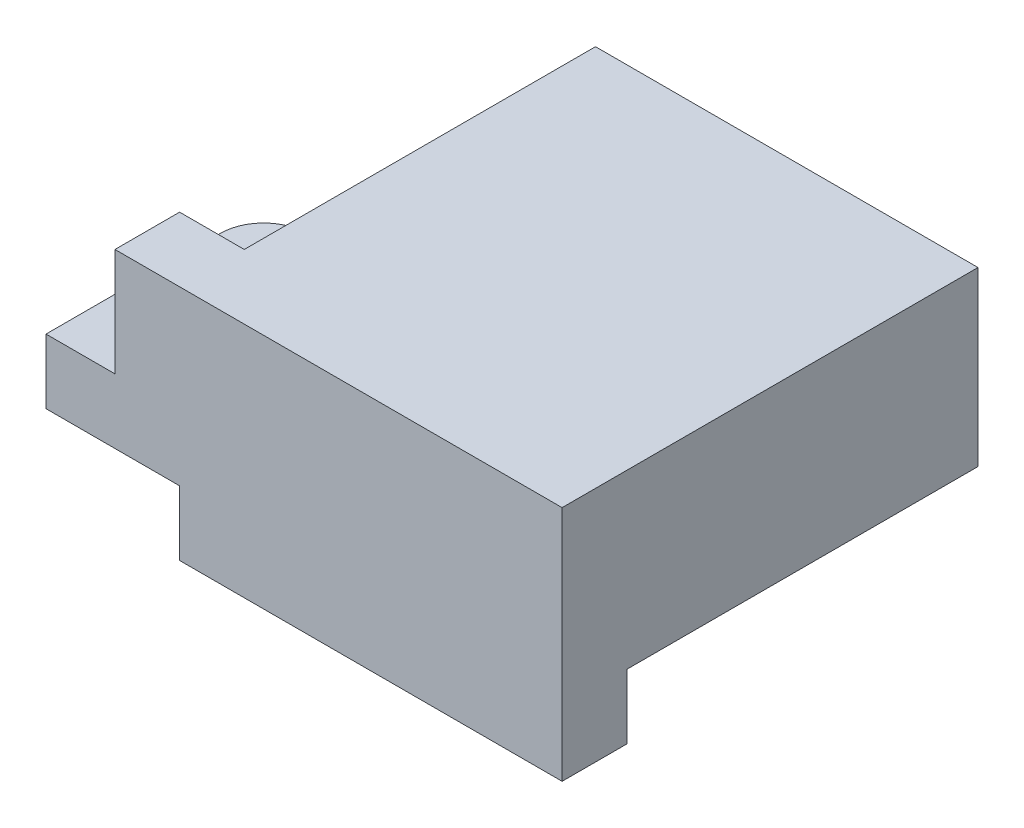
ISO-10303-21;
HEADER;
FILE_DESCRIPTION(('STEP AP214'),'2;1');
FILE_NAME('part.step','',(''),(''),'','','');
FILE_SCHEMA(('AUTOMOTIVE_DESIGN { 1 0 10303 214 1 1 1 1 }'));
ENDSEC;
DATA;
#1=APPLICATION_CONTEXT('core data for automotive mechanical design processes');
#2=APPLICATION_PROTOCOL_DEFINITION('international standard','automotive_design',2000,#1);
#3=PRODUCT_CONTEXT('',#1,'mechanical');
#4=PRODUCT('Part','Part','',(#3));
#5=PRODUCT_RELATED_PRODUCT_CATEGORY('part','',(#4));
#6=PRODUCT_DEFINITION_FORMATION('','',#4);
#7=PRODUCT_DEFINITION_CONTEXT('part definition',#1,'design');
#8=PRODUCT_DEFINITION('design','',#6,#7);
#9=PRODUCT_DEFINITION_SHAPE('','',#8);
#10=(LENGTH_UNIT() NAMED_UNIT(*) SI_UNIT(.MILLI.,.METRE.));
#11=(NAMED_UNIT(*) PLANE_ANGLE_UNIT() SI_UNIT($,.RADIAN.));
#12=(NAMED_UNIT(*) SI_UNIT($,.STERADIAN.) SOLID_ANGLE_UNIT());
#13=UNCERTAINTY_MEASURE_WITH_UNIT(LENGTH_MEASURE(1.E-05),#10,'distance_accuracy_value','');
#14=(GEOMETRIC_REPRESENTATION_CONTEXT(3) GLOBAL_UNCERTAINTY_ASSIGNED_CONTEXT((#13)) GLOBAL_UNIT_ASSIGNED_CONTEXT((#10,
#11,#12)) REPRESENTATION_CONTEXT('',''));
#15=CARTESIAN_POINT('',(0.,0.,0.));
#16=DIRECTION('',(0.,0.,1.));
#17=DIRECTION('',(1.,0.,0.));
#18=AXIS2_PLACEMENT_3D('',#15,#16,#17);
#19=CARTESIAN_POINT('',(-146.083399220501,-24.7311663924978,-18.5004782565443));
#20=DIRECTION('',(0.,-1.,0.));
#21=DIRECTION('',(1.,0.,0.));
#22=AXIS2_PLACEMENT_3D('',#19,#20,#21);
#23=PLANE('',#22);
#24=DIRECTION('',(0.,0.,-1.));
#25=VECTOR('',#24,1.);
#26=CARTESIAN_POINT('',(-146.083399220501,-24.7311663924978,-28.1685064528419));
#27=LINE('',#26,#25);
#28=CARTESIAN_POINT('',(-146.083399220501,-24.7311663924978,13.6648268804915));
#29=VERTEX_POINT('',#28);
#30=CARTESIAN_POINT('',(-146.083399220501,-24.7311663924978,-18.5004782565443));
#31=VERTEX_POINT('',#30);
#32=EDGE_CURVE('E52',#29,#31,#27,.T.);
#33=ORIENTED_EDGE('',*,*,#32,.T.);
#34=DIRECTION('',(-1.,0.,0.));
#35=VECTOR('',#34,1.);
#36=CARTESIAN_POINT('',(-67.7500658871679,-24.7311663924978,-18.5004782565443));
#37=LINE('',#36,#35);
#38=CARTESIAN_POINT('',(-175.666732553835,-24.7311663924978,-18.5004782565443));
#39=VERTEX_POINT('',#38);
#40=EDGE_CURVE('E11',#31,#39,#37,.T.);
#41=ORIENTED_EDGE('',*,*,#40,.T.);
#42=DIRECTION('',(0.,0.,1.));
#43=VECTOR('',#42,1.);
#44=CARTESIAN_POINT('',(-175.666732553835,-24.7311663924978,12.6648268804915));
#45=LINE('',#44,#43);
#46=CARTESIAN_POINT('',(-175.666732553835,-24.7311663924978,8.66482688049147));
#47=VERTEX_POINT('',#46);
#48=EDGE_CURVE('E66',#39,#47,#45,.T.);
#49=ORIENTED_EDGE('',*,*,#48,.T.);
#50=DIRECTION('',(-1.,0.,0.));
#51=VECTOR('',#50,1.);
#52=CARTESIAN_POINT('',(-180.666732553835,-24.7311663924978,8.66482688049147));
#53=LINE('',#52,#51);
#54=CARTESIAN_POINT('',(-180.666732553835,-24.7311663924978,8.66482688049147));
#55=VERTEX_POINT('',#54);
#56=EDGE_CURVE('E232',#47,#55,#53,.T.);
#57=ORIENTED_EDGE('',*,*,#56,.T.);
#58=DIRECTION('',(0.,0.,-1.));
#59=VECTOR('',#58,1.);
#60=CARTESIAN_POINT('',(-180.666732553835,-24.7311663924978,12.6648268804915));
#61=LINE('',#60,#59);
#62=CARTESIAN_POINT('',(-180.666732553835,-24.7311663924978,13.6648268804915));
#63=VERTEX_POINT('',#62);
#64=EDGE_CURVE('E235',#63,#55,#61,.T.);
#65=ORIENTED_EDGE('',*,*,#64,.F.);
#66=DIRECTION('',(-1.,0.,0.));
#67=VECTOR('',#66,1.);
#68=CARTESIAN_POINT('',(45.1666007794988,-24.7311663924978,13.6648268804915));
#69=LINE('',#68,#67);
#70=EDGE_CURVE('E47',#29,#63,#69,.T.);
#71=ORIENTED_EDGE('',*,*,#70,.F.);
#72=EDGE_LOOP('',(#33,#41,#49,#57,#65,#71));
#73=FACE_BOUND('',#72,.T.);
#74=ADVANCED_FACE('F44',(#73),#23,.F.);
#75=CARTESIAN_POINT('',(-180.666732553835,-43.0644997258311,8.66482688049147));
#76=DIRECTION('',(0.,0.,-1.));
#77=DIRECTION('',(0.,-1.,0.));
#78=AXIS2_PLACEMENT_3D('',#75,#76,#77);
#79=PLANE('',#78);
#80=ORIENTED_EDGE('',*,*,#56,.F.);
#81=DIRECTION('',(0.,1.,0.));
#82=VECTOR('',#81,1.);
#83=CARTESIAN_POINT('',(-175.666732553835,176.935500274169,8.66482688049147));
#84=LINE('',#83,#82);
#85=CARTESIAN_POINT('',(-175.666732553835,-33.0644997258311,8.66482688049147));
#86=VERTEX_POINT('',#85);
#87=EDGE_CURVE('E227',#86,#47,#84,.T.);
#88=ORIENTED_EDGE('',*,*,#87,.F.);
#89=DIRECTION('',(-1.,0.,0.));
#90=VECTOR('',#89,1.);
#91=CARTESIAN_POINT('',(-180.666732553835,-33.0644997258311,8.66482688049147));
#92=LINE('',#91,#90);
#93=CARTESIAN_POINT('',(-180.666732553835,-33.0644997258311,8.66482688049147));
#94=VERTEX_POINT('',#93);
#95=EDGE_CURVE('E280',#86,#94,#92,.T.);
#96=ORIENTED_EDGE('',*,*,#95,.T.);
#97=DIRECTION('',(0.,-1.,0.));
#98=VECTOR('',#97,1.);
#99=CARTESIAN_POINT('',(-180.666732553835,176.935500274169,8.66482688049147));
#100=LINE('',#99,#98);
#101=EDGE_CURVE('E224',#55,#94,#100,.T.);
#102=ORIENTED_EDGE('',*,*,#101,.F.);
#103=EDGE_LOOP('',(#80,#88,#96,#102));
#104=FACE_BOUND('',#103,.T.);
#105=ADVANCED_FACE('F350',(#104),#79,.T.);
#106=CARTESIAN_POINT('',(-180.666732553835,-43.0644997258311,12.6648268804915));
#107=DIRECTION('',(1.,0.,0.));
#108=DIRECTION('',(0.,1.,0.));
#109=AXIS2_PLACEMENT_3D('',#106,#107,#108);
#110=PLANE('',#109);
#111=DIRECTION('',(0.,-1.,0.));
#112=VECTOR('',#111,1.);
#113=CARTESIAN_POINT('',(-180.666732553835,-33.0644997258311,13.6648268804915));
#114=LINE('',#113,#112);
#115=CARTESIAN_POINT('',(-180.666732553835,-33.0644997258311,13.6648268804915));
#116=VERTEX_POINT('',#115);
#117=EDGE_CURVE('E226',#63,#116,#114,.T.);
#118=ORIENTED_EDGE('',*,*,#117,.F.);
#119=ORIENTED_EDGE('',*,*,#64,.T.);
#120=ORIENTED_EDGE('',*,*,#101,.T.);
#121=DIRECTION('',(0.,0.,-1.));
#122=VECTOR('',#121,1.);
#123=CARTESIAN_POINT('',(-180.666732553835,-33.0644997258311,12.6648268804915));
#124=LINE('',#123,#122);
#125=EDGE_CURVE('E276',#116,#94,#124,.T.);
#126=ORIENTED_EDGE('',*,*,#125,.F.);
#127=EDGE_LOOP('',(#118,#119,#120,#126));
#128=FACE_BOUND('',#127,.T.);
#129=ADVANCED_FACE('F353',(#128),#110,.F.);
#130=CARTESIAN_POINT('',(-175.666732553835,-43.0644997258311,12.6648268804915));
#131=DIRECTION('',(-1.,0.,0.));
#132=DIRECTION('',(0.,0.,1.));
#133=AXIS2_PLACEMENT_3D('',#130,#131,#132);
#134=PLANE('',#133);
#135=ORIENTED_EDGE('',*,*,#48,.F.);
#136=DIRECTION('',(0.,1.,0.));
#137=VECTOR('',#136,1.);
#138=CARTESIAN_POINT('',(-175.666732553835,-43.0644997258311,-18.5004782565443));
#139=LINE('',#138,#137);
#140=CARTESIAN_POINT('',(-175.666732553835,-38.0644997258311,-18.5004782565443));
#141=VERTEX_POINT('',#140);
#142=EDGE_CURVE('E217',#141,#39,#139,.T.);
#143=ORIENTED_EDGE('',*,*,#142,.F.);
#144=DIRECTION('',(0.,0.,-1.));
#145=VECTOR('',#144,1.);
#146=CARTESIAN_POINT('',(-175.666732553835,-38.0644997258311,8.66482688049147));
#147=LINE('',#146,#145);
#148=CARTESIAN_POINT('',(-175.666732553835,-38.0644997258311,-3.16850645284186));
#149=VERTEX_POINT('',#148);
#150=EDGE_CURVE('E246',#149,#141,#147,.T.);
#151=ORIENTED_EDGE('',*,*,#150,.F.);
#152=DIRECTION('',(0.,1.,0.));
#153=VECTOR('',#152,1.);
#154=CARTESIAN_POINT('',(-175.666732553835,-43.0644997258311,-3.16850645284186));
#155=LINE('',#154,#153);
#156=CARTESIAN_POINT('',(-175.666732553835,-33.0644997258311,-3.16850645284186));
#157=VERTEX_POINT('',#156);
#158=EDGE_CURVE('E281',#149,#157,#155,.T.);
#159=ORIENTED_EDGE('',*,*,#158,.T.);
#160=DIRECTION('',(0.,0.,-1.));
#161=VECTOR('',#160,1.);
#162=CARTESIAN_POINT('',(-175.666732553835,-33.0644997258311,4.33149354715814));
#163=LINE('',#162,#161);
#164=EDGE_CURVE('E302',#86,#157,#163,.T.);
#165=ORIENTED_EDGE('',*,*,#164,.F.);
#166=ORIENTED_EDGE('',*,*,#87,.T.);
#167=EDGE_LOOP('',(#135,#143,#151,#159,#165,#166));
#168=FACE_BOUND('',#167,.T.);
#169=ADVANCED_FACE('F254',(#168),#134,.T.);
#170=CARTESIAN_POINT('',(45.1666007794988,-43.0644997258311,13.6648268804915));
#171=DIRECTION('',(0.,0.,-1.));
#172=DIRECTION('',(0.,-1.,0.));
#173=AXIS2_PLACEMENT_3D('',#170,#171,#172);
#174=PLANE('',#173);
#175=DIRECTION('',(0.,-1.,0.));
#176=VECTOR('',#175,1.);
#177=CARTESIAN_POINT('',(-146.083399220501,-43.0644997258312,13.6648268804915));
#178=LINE('',#177,#176);
#179=CARTESIAN_POINT('',(-146.083399220501,-43.0644997258311,13.6648268804915));
#180=VERTEX_POINT('',#179);
#181=EDGE_CURVE('E173',#29,#180,#178,.T.);
#182=ORIENTED_EDGE('',*,*,#181,.F.);
#183=ORIENTED_EDGE('',*,*,#70,.T.);
#184=ORIENTED_EDGE('',*,*,#117,.T.);
#185=DIRECTION('',(-1.,0.,0.));
#186=VECTOR('',#185,1.);
#187=CARTESIAN_POINT('',(-180.666732553835,-33.0644997258311,13.6648268804915));
#188=LINE('',#187,#186);
#189=CARTESIAN_POINT('',(-186.000065887168,-33.0644997258311,13.6648268804915));
#190=VERTEX_POINT('',#189);
#191=EDGE_CURVE('E285',#116,#190,#188,.T.);
#192=ORIENTED_EDGE('',*,*,#191,.T.);
#193=DIRECTION('',(0.,-1.,0.));
#194=VECTOR('',#193,1.);
#195=CARTESIAN_POINT('',(-186.000065887168,-33.0644997258311,13.6648268804915));
#196=LINE('',#195,#194);
#197=CARTESIAN_POINT('',(-186.000065887168,-38.0644997258311,13.6648268804915));
#198=VERTEX_POINT('',#197);
#199=EDGE_CURVE('E293',#190,#198,#196,.T.);
#200=ORIENTED_EDGE('',*,*,#199,.T.);
#201=DIRECTION('',(1.,0.,0.));
#202=VECTOR('',#201,1.);
#203=CARTESIAN_POINT('',(-186.000065887168,-38.0644997258311,13.6648268804915));
#204=LINE('',#203,#202);
#205=CARTESIAN_POINT('',(-175.666732553835,-38.0644997258311,13.6648268804915));
#206=VERTEX_POINT('',#205);
#207=EDGE_CURVE('E314',#198,#206,#204,.T.);
#208=ORIENTED_EDGE('',*,*,#207,.T.);
#209=DIRECTION('',(0.,-1.,0.));
#210=VECTOR('',#209,1.);
#211=CARTESIAN_POINT('',(-175.666732553835,-43.0644997258311,13.6648268804915));
#212=LINE('',#211,#210);
#213=CARTESIAN_POINT('',(-175.666732553835,-43.0644997258311,13.6648268804915));
#214=VERTEX_POINT('',#213);
#215=EDGE_CURVE('E188',#206,#214,#212,.T.);
#216=ORIENTED_EDGE('',*,*,#215,.T.);
#217=DIRECTION('',(1.,0.,0.));
#218=VECTOR('',#217,1.);
#219=CARTESIAN_POINT('',(40.1666007794988,-43.0644997258311,13.6648268804915));
#220=LINE('',#219,#218);
#221=EDGE_CURVE('E185',#214,#180,#220,.T.);
#222=ORIENTED_EDGE('',*,*,#221,.T.);
#223=EDGE_LOOP('',(#182,#183,#184,#192,#200,#208,#216,#222));
#224=FACE_BOUND('',#223,.T.);
#225=ADVANCED_FACE('F186',(#224),#174,.F.);
#226=CARTESIAN_POINT('',(-146.083399220501,113.612396226726,-28.1685064528419));
#227=DIRECTION('',(1.,0.,0.));
#228=DIRECTION('',(0.,1.,0.));
#229=AXIS2_PLACEMENT_3D('',#226,#227,#228);
#230=PLANE('',#229);
#231=ORIENTED_EDGE('',*,*,#32,.F.);
#232=ORIENTED_EDGE('',*,*,#181,.T.);
#233=DIRECTION('',(0.,0.,1.));
#234=VECTOR('',#233,1.);
#235=CARTESIAN_POINT('',(-146.083399220501,-43.0644997258312,12.6648268804915));
#236=LINE('',#235,#234);
#237=CARTESIAN_POINT('',(-146.083399220501,-43.0644997258311,8.66482688049147));
#238=VERTEX_POINT('',#237);
#239=EDGE_CURVE('E178',#238,#180,#236,.T.);
#240=ORIENTED_EDGE('',*,*,#239,.F.);
#241=DIRECTION('',(0.,1.,0.));
#242=VECTOR('',#241,1.);
#243=CARTESIAN_POINT('',(-146.083399220501,-43.0644997258312,8.66482688049147));
#244=LINE('',#243,#242);
#245=CARTESIAN_POINT('',(-146.083399220501,-38.0644997258311,8.66482688049147));
#246=VERTEX_POINT('',#245);
#247=EDGE_CURVE('E182',#238,#246,#244,.T.);
#248=ORIENTED_EDGE('',*,*,#247,.T.);
#249=DIRECTION('',(0.,0.,-1.));
#250=VECTOR('',#249,1.);
#251=CARTESIAN_POINT('',(-146.083399220501,-38.0644997258311,8.66482688049147));
#252=LINE('',#251,#250);
#253=CARTESIAN_POINT('',(-146.083399220501,-38.0644997258315,-18.5004782565443));
#254=VERTEX_POINT('',#253);
#255=EDGE_CURVE('E205',#246,#254,#252,.T.);
#256=ORIENTED_EDGE('',*,*,#255,.T.);
#257=DIRECTION('',(0.,-1.,0.));
#258=VECTOR('',#257,1.);
#259=CARTESIAN_POINT('',(-146.083399220501,-43.0644997258313,-18.5004782565443));
#260=LINE('',#259,#258);
#261=EDGE_CURVE('E199',#31,#254,#260,.T.);
#262=ORIENTED_EDGE('',*,*,#261,.F.);
#263=EDGE_LOOP('',(#231,#232,#240,#248,#256,#262));
#264=FACE_BOUND('',#263,.T.);
#265=ADVANCED_FACE('F175',(#264),#230,.T.);
#266=CARTESIAN_POINT('',(-67.7500658871679,-43.0644997258313,-18.5004782565443));
#267=DIRECTION('',(0.,0.,-1.));
#268=DIRECTION('',(0.,-1.,0.));
#269=AXIS2_PLACEMENT_3D('',#266,#267,#268);
#270=PLANE('',#269);
#271=ORIENTED_EDGE('',*,*,#40,.F.);
#272=ORIENTED_EDGE('',*,*,#261,.T.);
#273=DIRECTION('',(1.,0.,0.));
#274=VECTOR('',#273,1.);
#275=CARTESIAN_POINT('',(-67.7500658871679,-38.0644997258313,-18.5004782565443));
#276=LINE('',#275,#274);
#277=EDGE_CURVE('E214',#141,#254,#276,.T.);
#278=ORIENTED_EDGE('',*,*,#277,.F.);
#279=ORIENTED_EDGE('',*,*,#142,.T.);
#280=EDGE_LOOP('',(#271,#272,#278,#279));
#281=FACE_BOUND('',#280,.T.);
#282=ADVANCED_FACE('F240',(#281),#270,.T.);
#283=CARTESIAN_POINT('',(-186.000065887168,-43.0644997258311,-3.16850645284186));
#284=DIRECTION('',(0.,0.,1.));
#285=DIRECTION('',(1.,0.,0.));
#286=AXIS2_PLACEMENT_3D('',#283,#284,#285);
#287=PLANE('',#286);
#288=DIRECTION('',(1.,0.,0.));
#289=VECTOR('',#288,1.);
#290=CARTESIAN_POINT('',(-186.000065887168,-33.0644997258311,-3.16850645284186));
#291=LINE('',#290,#289);
#292=CARTESIAN_POINT('',(-182.666732553835,-33.0644997258311,-3.16850645284186));
#293=VERTEX_POINT('',#292);
#294=EDGE_CURVE('E282',#293,#157,#291,.T.);
#295=ORIENTED_EDGE('',*,*,#294,.T.);
#296=ORIENTED_EDGE('',*,*,#158,.F.);
#297=DIRECTION('',(1.,0.,0.));
#298=VECTOR('',#297,1.);
#299=CARTESIAN_POINT('',(-186.000065887168,-38.0644997258311,-3.16850645284186));
#300=LINE('',#299,#298);
#301=CARTESIAN_POINT('',(-182.666732553835,-38.0644997258311,-3.16850645284186));
#302=VERTEX_POINT('',#301);
#303=EDGE_CURVE('E249',#302,#149,#300,.T.);
#304=ORIENTED_EDGE('',*,*,#303,.F.);
#305=DIRECTION('',(0.,-1.,0.));
#306=VECTOR('',#305,1.);
#307=CARTESIAN_POINT('',(-182.666732553835,-38.0644997258311,-3.16850645284186));
#308=LINE('',#307,#306);
#309=EDGE_CURVE('E296',#293,#302,#308,.T.);
#310=ORIENTED_EDGE('',*,*,#309,.F.);
#311=EDGE_LOOP('',(#295,#296,#304,#310));
#312=FACE_BOUND('',#311,.T.);
#313=ADVANCED_FACE('F358',(#312),#287,.F.);
#314=CARTESIAN_POINT('',(-182.666732553835,-43.0644997258311,0.164826880491474));
#315=DIRECTION('',(0.,-1.,0.));
#316=DIRECTION('',(-1.,0.,0.));
#317=AXIS2_PLACEMENT_3D('',#314,#315,#316);
#318=CYLINDRICAL_SURFACE('',#317,3.33333333333333);
#319=CARTESIAN_POINT('',(-182.666732553835,-38.0644997258311,0.164826880491474));
#320=DIRECTION('',(0.,1.,0.));
#321=DIRECTION('',(0.,0.,1.));
#322=AXIS2_PLACEMENT_3D('',#319,#320,#321);
#323=CIRCLE('',#322,3.33333333333333);
#324=CARTESIAN_POINT('',(-186.000065887168,-38.0644997258311,0.164826880491474));
#325=VERTEX_POINT('',#324);
#326=EDGE_CURVE('E269',#302,#325,#323,.T.);
#327=ORIENTED_EDGE('',*,*,#326,.T.);
#328=DIRECTION('',(0.,1.,0.));
#329=VECTOR('',#328,1.);
#330=CARTESIAN_POINT('',(-186.000065887168,-33.0644997258311,0.164826880491474));
#331=LINE('',#330,#329);
#332=CARTESIAN_POINT('',(-186.000065887168,-33.0644997258311,0.164826880491474));
#333=VERTEX_POINT('',#332);
#334=EDGE_CURVE('E229',#325,#333,#331,.T.);
#335=ORIENTED_EDGE('',*,*,#334,.T.);
#336=CARTESIAN_POINT('',(-182.666732553835,-33.0644997258311,0.164826880491474));
#337=DIRECTION('',(0.,-1.,0.));
#338=DIRECTION('',(1.,0.,0.));
#339=AXIS2_PLACEMENT_3D('',#336,#337,#338);
#340=CIRCLE('',#339,3.33333333333333);
#341=EDGE_CURVE('E284',#333,#293,#340,.T.);
#342=ORIENTED_EDGE('',*,*,#341,.T.);
#343=ORIENTED_EDGE('',*,*,#309,.T.);
#344=EDGE_LOOP('',(#327,#335,#342,#343));
#345=FACE_BOUND('',#344,.T.);
#346=ADVANCED_FACE('F357',(#345),#318,.T.);
#347=CARTESIAN_POINT('',(-181.333399220501,-43.0644997258311,2.16482688049147));
#348=DIRECTION('',(0.,1.,0.));
#349=DIRECTION('',(1.,0.,0.));
#350=AXIS2_PLACEMENT_3D('',#347,#348,#349);
#351=CYLINDRICAL_SURFACE('',#350,2.66666666666667);
#352=DIRECTION('',(0.,1.,0.));
#353=VECTOR('',#352,1.);
#354=CARTESIAN_POINT('',(-184.000065887168,-43.0644997258311,2.16482688049147));
#355=LINE('',#354,#353);
#356=CARTESIAN_POINT('',(-184.000065887168,-38.0644997258311,2.16482688049147));
#357=VERTEX_POINT('',#356);
#358=CARTESIAN_POINT('',(-184.000065887168,-33.0644997258311,2.16482688049147));
#359=VERTEX_POINT('',#358);
#360=EDGE_CURVE('E203',#357,#359,#355,.T.);
#361=ORIENTED_EDGE('',*,*,#360,.F.);
#362=CARTESIAN_POINT('',(-181.333399220501,-38.0644997258311,2.16482688049147));
#363=DIRECTION('',(0.,-1.,0.));
#364=DIRECTION('',(0.,0.,1.));
#365=AXIS2_PLACEMENT_3D('',#362,#363,#364);
#366=CIRCLE('',#365,2.66666666666667);
#367=CARTESIAN_POINT('',(-178.666732553835,-38.0644997258311,2.16482688049147));
#368=VERTEX_POINT('',#367);
#369=EDGE_CURVE('E252',#357,#368,#366,.T.);
#370=ORIENTED_EDGE('',*,*,#369,.T.);
#371=DIRECTION('',(0.,1.,0.));
#372=VECTOR('',#371,1.);
#373=CARTESIAN_POINT('',(-178.666732553835,-43.0644997258311,2.16482688049147));
#374=LINE('',#373,#372);
#375=CARTESIAN_POINT('',(-178.666732553835,-33.0644997258311,2.16482688049147));
#376=VERTEX_POINT('',#375);
#377=EDGE_CURVE('E218',#368,#376,#374,.T.);
#378=ORIENTED_EDGE('',*,*,#377,.T.);
#379=CARTESIAN_POINT('',(-181.333399220501,-33.0644997258311,2.16482688049147));
#380=DIRECTION('',(0.,-1.,0.));
#381=DIRECTION('',(1.,0.,0.));
#382=AXIS2_PLACEMENT_3D('',#379,#380,#381);
#383=CIRCLE('',#382,2.66666666666667);
#384=EDGE_CURVE('E289',#359,#376,#383,.T.);
#385=ORIENTED_EDGE('',*,*,#384,.F.);
#386=EDGE_LOOP('',(#361,#370,#378,#385));
#387=FACE_BOUND('',#386,.T.);
#388=ADVANCED_FACE('F366',(#387),#351,.F.);
#389=CARTESIAN_POINT('',(-181.333399220501,-43.0644997258311,2.16482688049147));
#390=DIRECTION('',(0.,1.,0.));
#391=DIRECTION('',(1.,0.,0.));
#392=AXIS2_PLACEMENT_3D('',#389,#390,#391);
#393=CYLINDRICAL_SURFACE('',#392,2.66666666666667);
#394=CARTESIAN_POINT('',(-181.333399220501,-38.0644997258311,2.16482688049147));
#395=DIRECTION('',(0.,-1.,0.));
#396=DIRECTION('',(0.,0.,1.));
#397=AXIS2_PLACEMENT_3D('',#394,#395,#396);
#398=CIRCLE('',#397,2.66666666666667);
#399=EDGE_CURVE('E198',#368,#357,#398,.T.);
#400=ORIENTED_EDGE('',*,*,#399,.T.);
#401=ORIENTED_EDGE('',*,*,#360,.T.);
#402=CARTESIAN_POINT('',(-181.333399220501,-33.0644997258311,2.16482688049147));
#403=DIRECTION('',(0.,-1.,0.));
#404=DIRECTION('',(1.,0.,0.));
#405=AXIS2_PLACEMENT_3D('',#402,#403,#404);
#406=CIRCLE('',#405,2.66666666666667);
#407=EDGE_CURVE('E263',#376,#359,#406,.T.);
#408=ORIENTED_EDGE('',*,*,#407,.F.);
#409=ORIENTED_EDGE('',*,*,#377,.F.);
#410=EDGE_LOOP('',(#400,#401,#408,#409));
#411=FACE_BOUND('',#410,.T.);
#412=ADVANCED_FACE('F392',(#411),#393,.F.);
#413=CARTESIAN_POINT('',(45.1666007794988,-43.0644997258311,8.66482688049147));
#414=DIRECTION('',(0.,0.,1.));
#415=DIRECTION('',(1.,0.,0.));
#416=AXIS2_PLACEMENT_3D('',#413,#414,#415);
#417=PLANE('',#416);
#418=ORIENTED_EDGE('',*,*,#247,.F.);
#419=DIRECTION('',(-1.,0.,0.));
#420=VECTOR('',#419,1.);
#421=CARTESIAN_POINT('',(40.1666007794988,-43.0644997258311,8.66482688049147));
#422=LINE('',#421,#420);
#423=CARTESIAN_POINT('',(-175.666732553835,-43.0644997258311,8.66482688049147));
#424=VERTEX_POINT('',#423);
#425=EDGE_CURVE('E194',#238,#424,#422,.T.);
#426=ORIENTED_EDGE('',*,*,#425,.T.);
#427=DIRECTION('',(0.,-1.,0.));
#428=VECTOR('',#427,1.);
#429=CARTESIAN_POINT('',(-175.666732553835,-43.0644997258311,8.66482688049147));
#430=LINE('',#429,#428);
#431=CARTESIAN_POINT('',(-175.666732553835,-38.0644997258311,8.66482688049147));
#432=VERTEX_POINT('',#431);
#433=EDGE_CURVE('E208',#432,#424,#430,.T.);
#434=ORIENTED_EDGE('',*,*,#433,.F.);
#435=DIRECTION('',(1.,0.,0.));
#436=VECTOR('',#435,1.);
#437=CARTESIAN_POINT('',(40.1666007794988,-38.0644997258311,8.66482688049147));
#438=LINE('',#437,#436);
#439=EDGE_CURVE('E220',#432,#246,#438,.T.);
#440=ORIENTED_EDGE('',*,*,#439,.T.);
#441=EDGE_LOOP('',(#418,#426,#434,#440));
#442=FACE_BOUND('',#441,.T.);
#443=ADVANCED_FACE('F394',(#442),#417,.F.);
#444=CARTESIAN_POINT('',(45.1666007794988,-43.0644997258311,12.6648268804915));
#445=DIRECTION('',(0.,-1.,0.));
#446=DIRECTION('',(0.,0.,-1.));
#447=AXIS2_PLACEMENT_3D('',#444,#445,#446);
#448=PLANE('',#447);
#449=ORIENTED_EDGE('',*,*,#425,.F.);
#450=ORIENTED_EDGE('',*,*,#239,.T.);
#451=ORIENTED_EDGE('',*,*,#221,.F.);
#452=DIRECTION('',(0.,0.,-1.));
#453=VECTOR('',#452,1.);
#454=CARTESIAN_POINT('',(-175.666732553835,-43.0644997258311,12.6648268804915));
#455=LINE('',#454,#453);
#456=EDGE_CURVE('E193',#214,#424,#455,.T.);
#457=ORIENTED_EDGE('',*,*,#456,.T.);
#458=EDGE_LOOP('',(#449,#450,#451,#457));
#459=FACE_BOUND('',#458,.T.);
#460=ADVANCED_FACE('F197',(#459),#448,.T.);
#461=CARTESIAN_POINT('',(-175.666732553835,-43.0644997258311,12.6648268804915));
#462=DIRECTION('',(-1.,0.,0.));
#463=DIRECTION('',(0.,0.,1.));
#464=AXIS2_PLACEMENT_3D('',#461,#462,#463);
#465=PLANE('',#464);
#466=ORIENTED_EDGE('',*,*,#433,.T.);
#467=ORIENTED_EDGE('',*,*,#456,.F.);
#468=ORIENTED_EDGE('',*,*,#215,.F.);
#469=DIRECTION('',(0.,0.,-1.));
#470=VECTOR('',#469,1.);
#471=CARTESIAN_POINT('',(-175.666732553835,-38.0644997258311,4.33149354715814));
#472=LINE('',#471,#470);
#473=EDGE_CURVE('E223',#206,#432,#472,.T.);
#474=ORIENTED_EDGE('',*,*,#473,.T.);
#475=EDGE_LOOP('',(#466,#467,#468,#474));
#476=FACE_BOUND('',#475,.T.);
#477=ADVANCED_FACE('F325',(#476),#465,.T.);
#478=CARTESIAN_POINT('',(40.1666007794988,-38.0644997258311,8.66482688049147));
#479=DIRECTION('',(0.,1.,0.));
#480=DIRECTION('',(1.,0.,0.));
#481=AXIS2_PLACEMENT_3D('',#478,#479,#480);
#482=PLANE('',#481);
#483=ORIENTED_EDGE('',*,*,#399,.F.);
#484=ORIENTED_EDGE('',*,*,#369,.F.);
#485=EDGE_LOOP('',(#483,#484));
#486=FACE_BOUND('',#485,.T.);
#487=ORIENTED_EDGE('',*,*,#255,.F.);
#488=ORIENTED_EDGE('',*,*,#439,.F.);
#489=ORIENTED_EDGE('',*,*,#473,.F.);
#490=ORIENTED_EDGE('',*,*,#207,.F.);
#491=DIRECTION('',(0.,0.,-1.));
#492=VECTOR('',#491,1.);
#493=CARTESIAN_POINT('',(-186.000065887168,-38.0644997258311,4.33149354715814));
#494=LINE('',#493,#492);
#495=EDGE_CURVE('E273',#198,#325,#494,.T.);
#496=ORIENTED_EDGE('',*,*,#495,.T.);
#497=ORIENTED_EDGE('',*,*,#326,.F.);
#498=ORIENTED_EDGE('',*,*,#303,.T.);
#499=ORIENTED_EDGE('',*,*,#150,.T.);
#500=ORIENTED_EDGE('',*,*,#277,.T.);
#501=EDGE_LOOP('',(#487,#488,#489,#490,#496,#497,#498,#499,#500));
#502=FACE_BOUND('',#501,.T.);
#503=ADVANCED_FACE('F242',(#486,#502),#482,.F.);
#504=CARTESIAN_POINT('',(-186.000065887168,-43.0644997258311,4.33149354715814));
#505=DIRECTION('',(-1.,0.,0.));
#506=DIRECTION('',(0.,0.,1.));
#507=AXIS2_PLACEMENT_3D('',#504,#505,#506);
#508=PLANE('',#507);
#509=ORIENTED_EDGE('',*,*,#495,.F.);
#510=ORIENTED_EDGE('',*,*,#199,.F.);
#511=DIRECTION('',(0.,0.,-1.));
#512=VECTOR('',#511,1.);
#513=CARTESIAN_POINT('',(-186.000065887168,-33.0644997258311,4.33149354715814));
#514=LINE('',#513,#512);
#515=EDGE_CURVE('E292',#190,#333,#514,.T.);
#516=ORIENTED_EDGE('',*,*,#515,.T.);
#517=ORIENTED_EDGE('',*,*,#334,.F.);
#518=EDGE_LOOP('',(#509,#510,#516,#517));
#519=FACE_BOUND('',#518,.T.);
#520=ADVANCED_FACE('F355',(#519),#508,.T.);
#521=CARTESIAN_POINT('',(-186.000065887168,-33.0644997258311,4.33149354715814));
#522=DIRECTION('',(0.,1.,0.));
#523=DIRECTION('',(1.,0.,0.));
#524=AXIS2_PLACEMENT_3D('',#521,#522,#523);
#525=PLANE('',#524);
#526=ORIENTED_EDGE('',*,*,#407,.T.);
#527=ORIENTED_EDGE('',*,*,#384,.T.);
#528=EDGE_LOOP('',(#526,#527));
#529=FACE_BOUND('',#528,.T.);
#530=ORIENTED_EDGE('',*,*,#515,.F.);
#531=ORIENTED_EDGE('',*,*,#191,.F.);
#532=ORIENTED_EDGE('',*,*,#125,.T.);
#533=ORIENTED_EDGE('',*,*,#95,.F.);
#534=ORIENTED_EDGE('',*,*,#164,.T.);
#535=ORIENTED_EDGE('',*,*,#294,.F.);
#536=ORIENTED_EDGE('',*,*,#341,.F.);
#537=EDGE_LOOP('',(#530,#531,#532,#533,#534,#535,#536));
#538=FACE_BOUND('',#537,.T.);
#539=ADVANCED_FACE('F344',(#529,#538),#525,.T.);
#540=CLOSED_SHELL('',(#74,#105,#129,#169,#225,#265,#282,#313,#346,#388,#412,#443,#460,#477,#503,
#520,#539));
#541=MANIFOLD_SOLID_BREP('B2',#540);
#542=ADVANCED_BREP_SHAPE_REPRESENTATION('',(#18,#541),#14);
#543=SHAPE_DEFINITION_REPRESENTATION(#9,#542);
ENDSEC;
END-ISO-10303-21;
